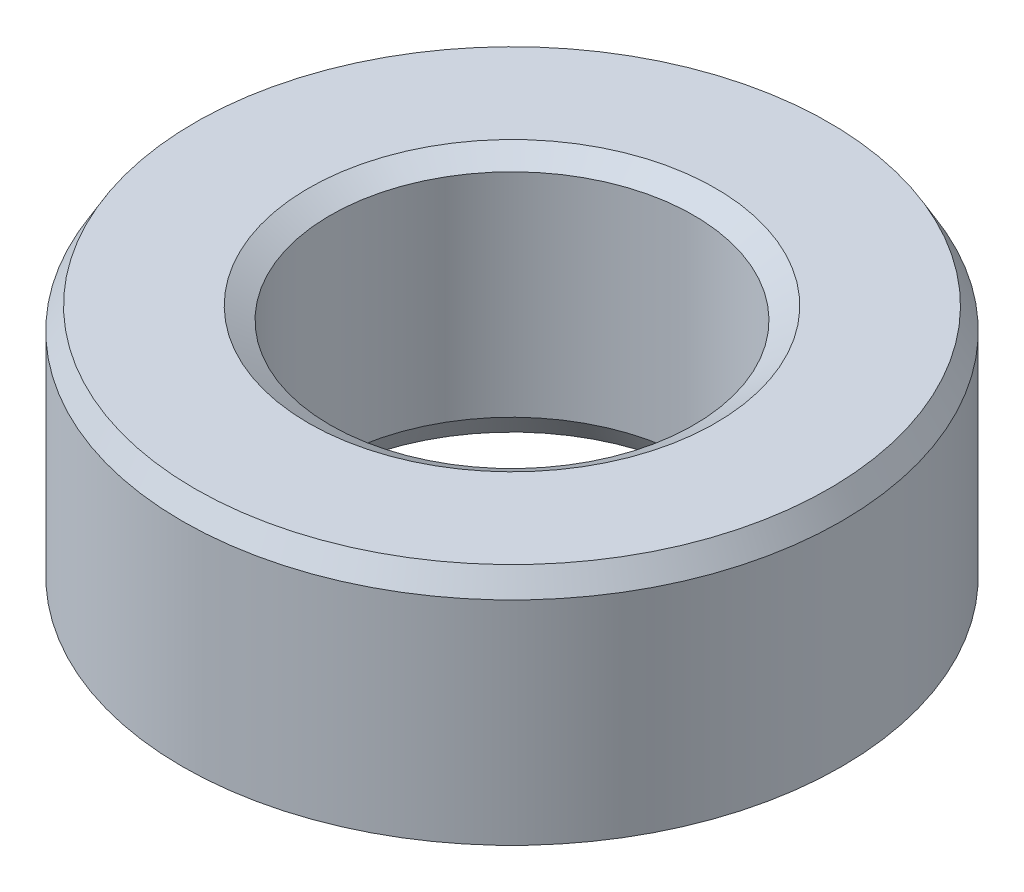
ISO-10303-21;
HEADER;
FILE_DESCRIPTION(('STEP AP214'),'2;1');
FILE_NAME('part.step','',(''),(''),'','','');
FILE_SCHEMA(('AUTOMOTIVE_DESIGN { 1 0 10303 214 1 1 1 1 }'));
ENDSEC;
DATA;
#1=APPLICATION_CONTEXT('core data for automotive mechanical design processes');
#2=APPLICATION_PROTOCOL_DEFINITION('international standard','automotive_design',2000,#1);
#3=PRODUCT_CONTEXT('',#1,'mechanical');
#4=PRODUCT('Part','Part','',(#3));
#5=PRODUCT_RELATED_PRODUCT_CATEGORY('part','',(#4));
#6=PRODUCT_DEFINITION_FORMATION('','',#4);
#7=PRODUCT_DEFINITION_CONTEXT('part definition',#1,'design');
#8=PRODUCT_DEFINITION('design','',#6,#7);
#9=PRODUCT_DEFINITION_SHAPE('','',#8);
#10=(LENGTH_UNIT() NAMED_UNIT(*) SI_UNIT(.MILLI.,.METRE.));
#11=(NAMED_UNIT(*) PLANE_ANGLE_UNIT() SI_UNIT($,.RADIAN.));
#12=(NAMED_UNIT(*) SI_UNIT($,.STERADIAN.) SOLID_ANGLE_UNIT());
#13=UNCERTAINTY_MEASURE_WITH_UNIT(LENGTH_MEASURE(1.E-05),#10,'distance_accuracy_value','');
#14=(GEOMETRIC_REPRESENTATION_CONTEXT(3) GLOBAL_UNCERTAINTY_ASSIGNED_CONTEXT((#13)) GLOBAL_UNIT_ASSIGNED_CONTEXT((#10,
#11,#12)) REPRESENTATION_CONTEXT('',''));
#15=CARTESIAN_POINT('',(0.,0.,0.));
#16=DIRECTION('',(0.,0.,1.));
#17=DIRECTION('',(1.,0.,0.));
#18=AXIS2_PLACEMENT_3D('',#15,#16,#17);
#19=CARTESIAN_POINT('',(0.,44.9282549307547,0.));
#20=DIRECTION('',(0.,-1.,0.));
#21=DIRECTION('',(0.,0.,-1.));
#22=AXIS2_PLACEMENT_3D('',#19,#20,#21);
#23=CYLINDRICAL_SURFACE('',#22,60.);
#24=CARTESIAN_POINT('',(0.,2.28770934199262,0.));
#25=DIRECTION('',(0.,1.,0.));
#26=DIRECTION('',(0.,0.,1.));
#27=AXIS2_PLACEMENT_3D('',#24,#25,#26);
#28=CIRCLE('',#27,60.);
#29=CARTESIAN_POINT('',(0.,2.28770934199262,60.));
#30=VERTEX_POINT('',#29);
#31=EDGE_CURVE('E10',#30,#30,#28,.T.);
#32=ORIENTED_EDGE('',*,*,#31,.T.);
#33=EDGE_LOOP('',(#32));
#34=FACE_BOUND('',#33,.T.);
#35=CARTESIAN_POINT('',(0.,40.9658261174736,0.));
#36=DIRECTION('',(0.,1.,0.));
#37=DIRECTION('',(0.,0.,1.));
#38=AXIS2_PLACEMENT_3D('',#35,#36,#37);
#39=CIRCLE('',#38,60.);
#40=CARTESIAN_POINT('',(0.,40.9658261174736,60.));
#41=VERTEX_POINT('',#40);
#42=EDGE_CURVE('E50',#41,#41,#39,.F.);
#43=ORIENTED_EDGE('',*,*,#42,.T.);
#44=EDGE_LOOP('',(#43));
#45=FACE_BOUND('',#44,.T.);
#46=ADVANCED_FACE('F39',(#34,#45),#23,.T.);
#47=CARTESIAN_POINT('',(0.,44.9282549307547,0.));
#48=DIRECTION('',(0.,1.,0.));
#49=DIRECTION('',(0.,0.,1.));
#50=AXIS2_PLACEMENT_3D('',#47,#48,#49);
#51=PLANE('',#50);
#52=CARTESIAN_POINT('',(0.,44.9282549307547,0.));
#53=DIRECTION('',(0.,1.,0.));
#54=DIRECTION('',(0.,0.,1.));
#55=AXIS2_PLACEMENT_3D('',#52,#53,#54);
#56=CIRCLE('',#55,37.0346272087627);
#57=CARTESIAN_POINT('',(0.,44.9282549307547,37.0346272087627));
#58=VERTEX_POINT('',#57);
#59=EDGE_CURVE('E58',#58,#58,#56,.F.);
#60=ORIENTED_EDGE('',*,*,#59,.T.);
#61=EDGE_LOOP('',(#60));
#62=FACE_BOUND('',#61,.T.);
#63=CARTESIAN_POINT('',(0.,44.9282549307547,0.));
#64=DIRECTION('',(0.,1.,0.));
#65=DIRECTION('',(0.,0.,1.));
#66=AXIS2_PLACEMENT_3D('',#63,#64,#65);
#67=CIRCLE('',#66,57.7122906580074);
#68=CARTESIAN_POINT('',(0.,44.9282549307547,57.7122906580074));
#69=VERTEX_POINT('',#68);
#70=EDGE_CURVE('E61',#69,#69,#67,.T.);
#71=ORIENTED_EDGE('',*,*,#70,.T.);
#72=EDGE_LOOP('',(#71));
#73=FACE_BOUND('',#72,.T.);
#74=ADVANCED_FACE('F88',(#62,#73),#51,.T.);
#75=CARTESIAN_POINT('',(0.,0.,0.));
#76=DIRECTION('',(0.,1.,0.));
#77=DIRECTION('',(0.,0.,1.));
#78=AXIS2_PLACEMENT_3D('',#75,#76,#77);
#79=PLANE('',#78);
#80=CARTESIAN_POINT('',(0.,0.,0.));
#81=DIRECTION('',(0.,1.,0.));
#82=DIRECTION('',(0.,0.,1.));
#83=AXIS2_PLACEMENT_3D('',#80,#81,#82);
#84=CIRCLE('',#83,35.3599077374741);
#85=CARTESIAN_POINT('',(0.,0.,35.3599077374741));
#86=VERTEX_POINT('',#85);
#87=EDGE_CURVE('E51',#86,#86,#84,.T.);
#88=ORIENTED_EDGE('',*,*,#87,.T.);
#89=EDGE_LOOP('',(#88));
#90=FACE_BOUND('',#89,.T.);
#91=CARTESIAN_POINT('',(0.,0.,0.));
#92=DIRECTION('',(0.,1.,0.));
#93=DIRECTION('',(0.,0.,1.));
#94=AXIS2_PLACEMENT_3D('',#91,#92,#93);
#95=CIRCLE('',#94,56.0375711867188);
#96=CARTESIAN_POINT('',(0.,0.,56.0375711867188));
#97=VERTEX_POINT('',#96);
#98=EDGE_CURVE('E54',#97,#97,#95,.F.);
#99=ORIENTED_EDGE('',*,*,#98,.T.);
#100=EDGE_LOOP('',(#99));
#101=FACE_BOUND('',#100,.T.);
#102=ADVANCED_FACE('F83',(#90,#101),#79,.F.);
#103=CARTESIAN_POINT('',(0.,44.9282549307547,0.));
#104=DIRECTION('',(0.,-1.,0.));
#105=DIRECTION('',(0.,0.,-1.));
#106=AXIS2_PLACEMENT_3D('',#103,#104,#105);
#107=CYLINDRICAL_SURFACE('',#106,33.0721983954815);
#108=CARTESIAN_POINT('',(0.,42.6405455887621,0.));
#109=DIRECTION('',(0.,1.,0.));
#110=DIRECTION('',(0.,0.,1.));
#111=AXIS2_PLACEMENT_3D('',#108,#109,#110);
#112=CIRCLE('',#111,33.0721983954815);
#113=CARTESIAN_POINT('',(0.,42.6405455887621,33.0721983954815));
#114=VERTEX_POINT('',#113);
#115=EDGE_CURVE('E67',#114,#114,#112,.T.);
#116=ORIENTED_EDGE('',*,*,#115,.T.);
#117=EDGE_LOOP('',(#116));
#118=FACE_BOUND('',#117,.T.);
#119=CARTESIAN_POINT('',(0.,3.96242881328121,0.));
#120=DIRECTION('',(0.,1.,0.));
#121=DIRECTION('',(0.,0.,1.));
#122=AXIS2_PLACEMENT_3D('',#119,#120,#121);
#123=CIRCLE('',#122,33.0721983954815);
#124=CARTESIAN_POINT('',(0.,3.96242881328121,33.0721983954815));
#125=VERTEX_POINT('',#124);
#126=EDGE_CURVE('E69',#125,#125,#123,.F.);
#127=ORIENTED_EDGE('',*,*,#126,.T.);
#128=EDGE_LOOP('',(#127));
#129=FACE_BOUND('',#128,.T.);
#130=ADVANCED_FACE('F71',(#118,#129),#107,.F.);
#131=CARTESIAN_POINT('',(0.,42.6405455887621,0.));
#132=DIRECTION('',(0.,1.,0.));
#133=DIRECTION('',(0.,0.,1.));
#134=AXIS2_PLACEMENT_3D('',#131,#132,#133);
#135=CONICAL_SURFACE('',#134,33.0721983954815,1.0471975511966);
#136=ORIENTED_EDGE('',*,*,#59,.F.);
#137=EDGE_LOOP('',(#136));
#138=FACE_BOUND('',#137,.T.);
#139=ORIENTED_EDGE('',*,*,#115,.F.);
#140=EDGE_LOOP('',(#139));
#141=FACE_BOUND('',#140,.T.);
#142=ADVANCED_FACE('F77',(#138,#141),#135,.F.);
#143=CARTESIAN_POINT('',(0.,0.,0.));
#144=DIRECTION('',(0.,-1.,0.));
#145=DIRECTION('',(0.,0.,-1.));
#146=AXIS2_PLACEMENT_3D('',#143,#144,#145);
#147=CONICAL_SURFACE('',#146,35.3599077374741,0.523598775598296);
#148=ORIENTED_EDGE('',*,*,#126,.F.);
#149=EDGE_LOOP('',(#148));
#150=FACE_BOUND('',#149,.T.);
#151=ORIENTED_EDGE('',*,*,#87,.F.);
#152=EDGE_LOOP('',(#151));
#153=FACE_BOUND('',#152,.T.);
#154=ADVANCED_FACE('F73',(#150,#153),#147,.F.);
#155=CARTESIAN_POINT('',(0.,2.28770934199262,0.));
#156=DIRECTION('',(0.,1.,0.));
#157=DIRECTION('',(0.,0.,1.));
#158=AXIS2_PLACEMENT_3D('',#155,#156,#157);
#159=CONICAL_SURFACE('',#158,60.,1.0471975511966);
#160=ORIENTED_EDGE('',*,*,#98,.F.);
#161=EDGE_LOOP('',(#160));
#162=FACE_BOUND('',#161,.T.);
#163=ORIENTED_EDGE('',*,*,#31,.F.);
#164=EDGE_LOOP('',(#163));
#165=FACE_BOUND('',#164,.T.);
#166=ADVANCED_FACE('F76',(#162,#165),#159,.T.);
#167=CARTESIAN_POINT('',(0.,44.9282549307547,0.));
#168=DIRECTION('',(0.,-1.,0.));
#169=DIRECTION('',(0.,0.,-1.));
#170=AXIS2_PLACEMENT_3D('',#167,#168,#169);
#171=CONICAL_SURFACE('',#170,57.7122906580074,0.523598775598296);
#172=ORIENTED_EDGE('',*,*,#42,.F.);
#173=EDGE_LOOP('',(#172));
#174=FACE_BOUND('',#173,.T.);
#175=ORIENTED_EDGE('',*,*,#70,.F.);
#176=EDGE_LOOP('',(#175));
#177=FACE_BOUND('',#176,.T.);
#178=ADVANCED_FACE('F45',(#174,#177),#171,.T.);
#179=CLOSED_SHELL('',(#46,#74,#102,#130,#142,#154,#166,#178));
#180=MANIFOLD_SOLID_BREP('B2',#179);
#181=ADVANCED_BREP_SHAPE_REPRESENTATION('',(#18,#180),#14);
#182=SHAPE_DEFINITION_REPRESENTATION(#9,#181);
ENDSEC;
END-ISO-10303-21;
